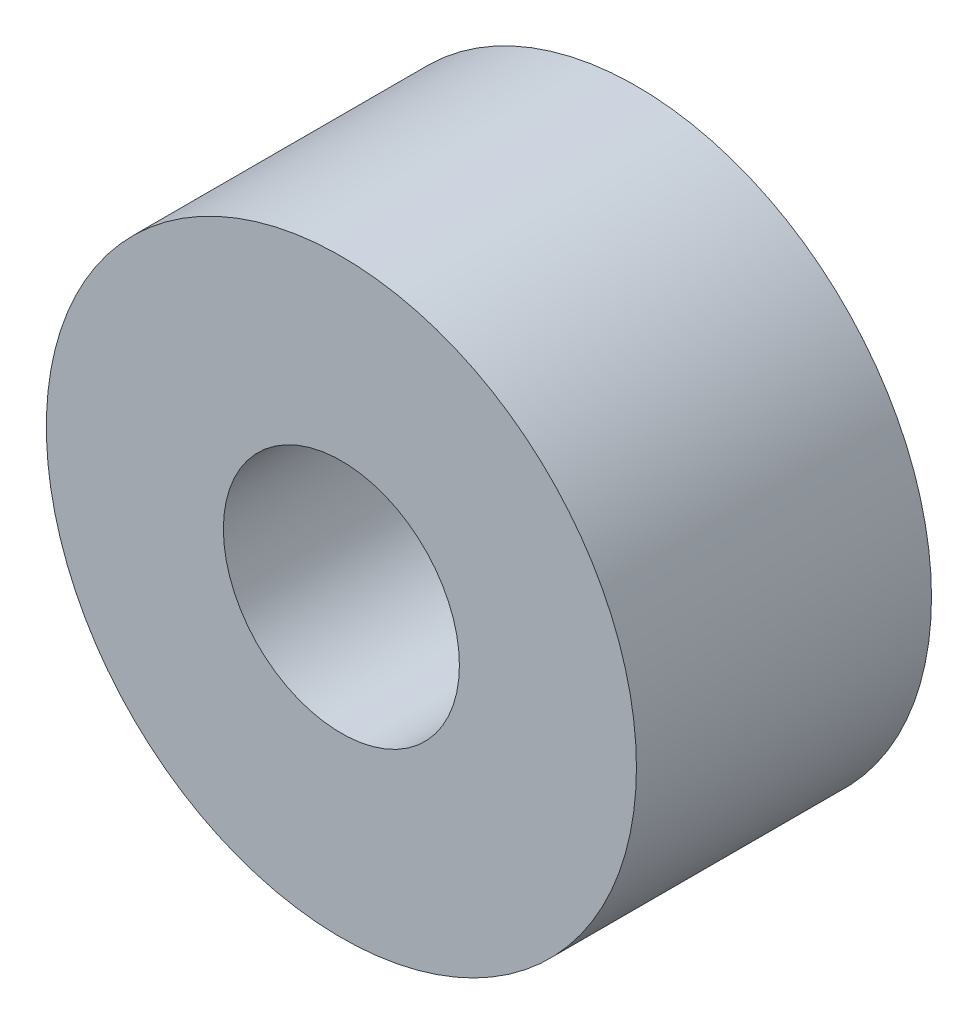
ISO-10303-21;
HEADER;
FILE_DESCRIPTION(('STEP AP214'),'2;1');
FILE_NAME('part.step','',(''),(''),'','','');
FILE_SCHEMA(('AUTOMOTIVE_DESIGN { 1 0 10303 214 1 1 1 1 }'));
ENDSEC;
DATA;
#1=APPLICATION_CONTEXT('core data for automotive mechanical design processes');
#2=APPLICATION_PROTOCOL_DEFINITION('international standard','automotive_design',2000,#1);
#3=PRODUCT_CONTEXT('',#1,'mechanical');
#4=PRODUCT('Part','Part','',(#3));
#5=PRODUCT_RELATED_PRODUCT_CATEGORY('part','',(#4));
#6=PRODUCT_DEFINITION_FORMATION('','',#4);
#7=PRODUCT_DEFINITION_CONTEXT('part definition',#1,'design');
#8=PRODUCT_DEFINITION('design','',#6,#7);
#9=PRODUCT_DEFINITION_SHAPE('','',#8);
#10=(LENGTH_UNIT() NAMED_UNIT(*) SI_UNIT(.MILLI.,.METRE.));
#11=(NAMED_UNIT(*) PLANE_ANGLE_UNIT() SI_UNIT($,.RADIAN.));
#12=(NAMED_UNIT(*) SI_UNIT($,.STERADIAN.) SOLID_ANGLE_UNIT());
#13=UNCERTAINTY_MEASURE_WITH_UNIT(LENGTH_MEASURE(1.E-05),#10,'distance_accuracy_value','');
#14=(GEOMETRIC_REPRESENTATION_CONTEXT(3) GLOBAL_UNCERTAINTY_ASSIGNED_CONTEXT((#13)) GLOBAL_UNIT_ASSIGNED_CONTEXT((#10,
#11,#12)) REPRESENTATION_CONTEXT('',''));
#15=CARTESIAN_POINT('',(0.,0.,0.));
#16=DIRECTION('',(0.,0.,1.));
#17=DIRECTION('',(1.,0.,0.));
#18=AXIS2_PLACEMENT_3D('',#15,#16,#17);
#19=CARTESIAN_POINT('',(0.,0.,2.));
#20=DIRECTION('',(0.,0.,1.));
#21=DIRECTION('',(1.,0.,0.));
#22=AXIS2_PLACEMENT_3D('',#19,#20,#21);
#23=PLANE('',#22);
#24=CARTESIAN_POINT('',(0.,0.,2.));
#25=DIRECTION('',(0.,0.,1.));
#26=DIRECTION('',(1.,0.,0.));
#27=AXIS2_PLACEMENT_3D('',#24,#25,#26);
#28=CIRCLE('',#27,4.);
#29=CARTESIAN_POINT('',(4.,0.,2.));
#30=VERTEX_POINT('',#29);
#31=EDGE_CURVE('E10',#30,#30,#28,.T.);
#32=ORIENTED_EDGE('',*,*,#31,.T.);
#33=EDGE_LOOP('',(#32));
#34=FACE_BOUND('',#33,.T.);
#35=CARTESIAN_POINT('',(0.,0.,2.));
#36=DIRECTION('',(0.,0.,1.));
#37=DIRECTION('',(1.,0.,0.));
#38=AXIS2_PLACEMENT_3D('',#35,#36,#37);
#39=CIRCLE('',#38,1.6);
#40=CARTESIAN_POINT('',(1.6,0.,2.));
#41=VERTEX_POINT('',#40);
#42=EDGE_CURVE('E37',#41,#41,#39,.T.);
#43=ORIENTED_EDGE('',*,*,#42,.F.);
#44=EDGE_LOOP('',(#43));
#45=FACE_BOUND('',#44,.T.);
#46=ADVANCED_FACE('F30',(#34,#45),#23,.T.);
#47=CARTESIAN_POINT('',(0.,0.,2.));
#48=DIRECTION('',(0.,0.,-1.));
#49=DIRECTION('',(-1.,0.,0.));
#50=AXIS2_PLACEMENT_3D('',#47,#48,#49);
#51=CYLINDRICAL_SURFACE('',#50,4.);
#52=ORIENTED_EDGE('',*,*,#31,.F.);
#53=EDGE_LOOP('',(#52));
#54=FACE_BOUND('',#53,.T.);
#55=CARTESIAN_POINT('',(0.,0.,-2.));
#56=DIRECTION('',(0.,0.,1.));
#57=DIRECTION('',(1.,0.,0.));
#58=AXIS2_PLACEMENT_3D('',#55,#56,#57);
#59=CIRCLE('',#58,4.);
#60=CARTESIAN_POINT('',(4.,0.,-2.));
#61=VERTEX_POINT('',#60);
#62=EDGE_CURVE('E41',#61,#61,#59,.T.);
#63=ORIENTED_EDGE('',*,*,#62,.T.);
#64=EDGE_LOOP('',(#63));
#65=FACE_BOUND('',#64,.T.);
#66=ADVANCED_FACE('F32',(#54,#65),#51,.T.);
#67=CARTESIAN_POINT('',(0.,0.,2.));
#68=DIRECTION('',(0.,0.,-1.));
#69=DIRECTION('',(-1.,0.,0.));
#70=AXIS2_PLACEMENT_3D('',#67,#68,#69);
#71=CYLINDRICAL_SURFACE('',#70,1.6);
#72=ORIENTED_EDGE('',*,*,#42,.T.);
#73=EDGE_LOOP('',(#72));
#74=FACE_BOUND('',#73,.T.);
#75=CARTESIAN_POINT('',(0.,0.,-2.));
#76=DIRECTION('',(0.,0.,1.));
#77=DIRECTION('',(1.,0.,0.));
#78=AXIS2_PLACEMENT_3D('',#75,#76,#77);
#79=CIRCLE('',#78,1.6);
#80=CARTESIAN_POINT('',(1.6,0.,-2.));
#81=VERTEX_POINT('',#80);
#82=EDGE_CURVE('E45',#81,#81,#79,.T.);
#83=ORIENTED_EDGE('',*,*,#82,.F.);
#84=EDGE_LOOP('',(#83));
#85=FACE_BOUND('',#84,.T.);
#86=ADVANCED_FACE('F54',(#74,#85),#71,.F.);
#87=CARTESIAN_POINT('',(0.,0.,-2.));
#88=DIRECTION('',(0.,0.,1.));
#89=DIRECTION('',(1.,0.,0.));
#90=AXIS2_PLACEMENT_3D('',#87,#88,#89);
#91=PLANE('',#90);
#92=ORIENTED_EDGE('',*,*,#82,.T.);
#93=EDGE_LOOP('',(#92));
#94=FACE_BOUND('',#93,.T.);
#95=ORIENTED_EDGE('',*,*,#62,.F.);
#96=EDGE_LOOP('',(#95));
#97=FACE_BOUND('',#96,.T.);
#98=ADVANCED_FACE('F51',(#94,#97),#91,.F.);
#99=CLOSED_SHELL('',(#46,#66,#86,#98));
#100=MANIFOLD_SOLID_BREP('B2',#99);
#101=ADVANCED_BREP_SHAPE_REPRESENTATION('',(#18,#100),#14);
#102=SHAPE_DEFINITION_REPRESENTATION(#9,#101);
ENDSEC;
END-ISO-10303-21;
